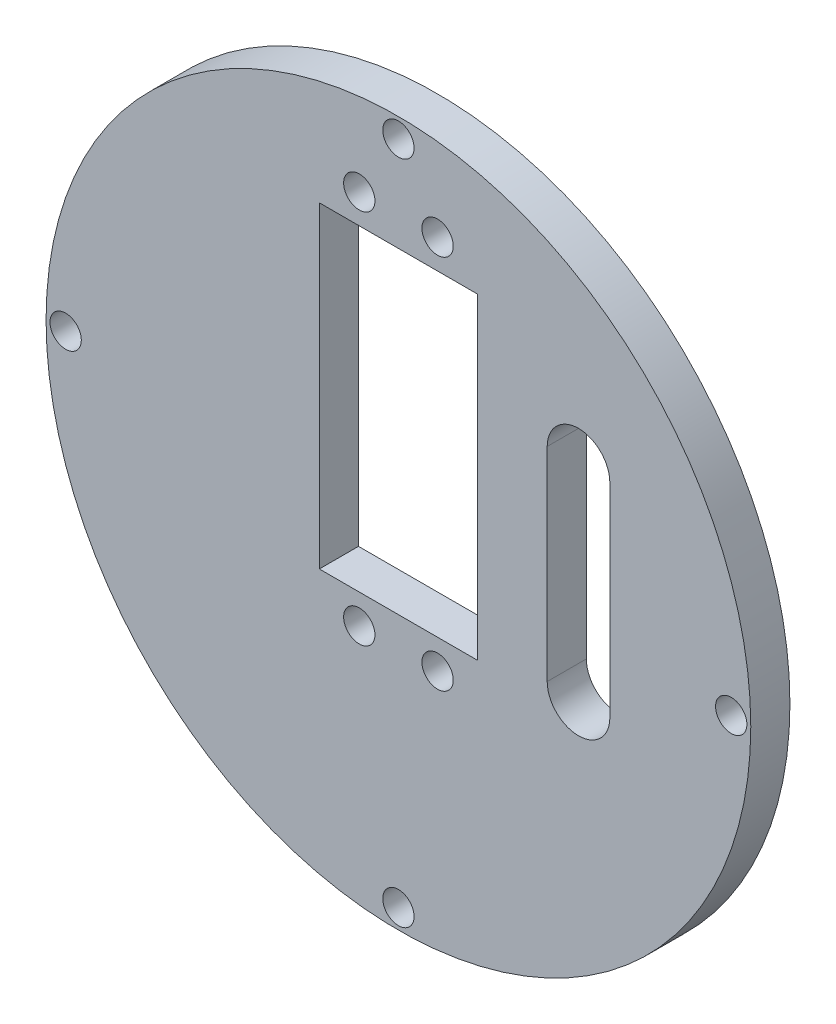
ISO-10303-21;
HEADER;
FILE_DESCRIPTION(('STEP AP214'),'2;1');
FILE_NAME('part.step','',(''),(''),'','','');
FILE_SCHEMA(('AUTOMOTIVE_DESIGN { 1 0 10303 214 1 1 1 1 }'));
ENDSEC;
DATA;
#1=APPLICATION_CONTEXT('core data for automotive mechanical design processes');
#2=APPLICATION_PROTOCOL_DEFINITION('international standard','automotive_design',2000,#1);
#3=PRODUCT_CONTEXT('',#1,'mechanical');
#4=PRODUCT('Part','Part','',(#3));
#5=PRODUCT_RELATED_PRODUCT_CATEGORY('part','',(#4));
#6=PRODUCT_DEFINITION_FORMATION('','',#4);
#7=PRODUCT_DEFINITION_CONTEXT('part definition',#1,'design');
#8=PRODUCT_DEFINITION('design','',#6,#7);
#9=PRODUCT_DEFINITION_SHAPE('','',#8);
#10=(LENGTH_UNIT() NAMED_UNIT(*) SI_UNIT(.MILLI.,.METRE.));
#11=(NAMED_UNIT(*) PLANE_ANGLE_UNIT() SI_UNIT($,.RADIAN.));
#12=(NAMED_UNIT(*) SI_UNIT($,.STERADIAN.) SOLID_ANGLE_UNIT());
#13=UNCERTAINTY_MEASURE_WITH_UNIT(LENGTH_MEASURE(1.E-05),#10,'distance_accuracy_value','');
#14=(GEOMETRIC_REPRESENTATION_CONTEXT(3) GLOBAL_UNCERTAINTY_ASSIGNED_CONTEXT((#13)) GLOBAL_UNIT_ASSIGNED_CONTEXT((#10,
#11,#12)) REPRESENTATION_CONTEXT('',''));
#15=CARTESIAN_POINT('',(0.,0.,0.));
#16=DIRECTION('',(0.,0.,1.));
#17=DIRECTION('',(1.,0.,0.));
#18=AXIS2_PLACEMENT_3D('',#15,#16,#17);
#19=CARTESIAN_POINT('',(0.,30.4,5.));
#20=DIRECTION('',(0.,1.,0.));
#21=DIRECTION('',(0.,0.,1.));
#22=AXIS2_PLACEMENT_3D('',#19,#20,#21);
#23=PLANE('',#22);
#24=DIRECTION('',(1.,0.,0.));
#25=VECTOR('',#24,1.);
#26=CARTESIAN_POINT('',(0.,30.4,0.));
#27=LINE('',#26,#25);
#28=CARTESIAN_POINT('',(-10.1,30.4,0.));
#29=VERTEX_POINT('',#28);
#30=CARTESIAN_POINT('',(10.1,30.4,0.));
#31=VERTEX_POINT('',#30);
#32=EDGE_CURVE('E203',#29,#31,#27,.T.);
#33=ORIENTED_EDGE('',*,*,#32,.T.);
#34=DIRECTION('',(0.,0.,-1.));
#35=VECTOR('',#34,1.);
#36=CARTESIAN_POINT('',(10.1,30.4,5.));
#37=LINE('',#36,#35);
#38=CARTESIAN_POINT('',(10.1,30.4,5.));
#39=VERTEX_POINT('',#38);
#40=EDGE_CURVE('E11',#39,#31,#37,.T.);
#41=ORIENTED_EDGE('',*,*,#40,.F.);
#42=DIRECTION('',(1.,0.,0.));
#43=VECTOR('',#42,1.);
#44=CARTESIAN_POINT('',(0.,30.4,5.));
#45=LINE('',#44,#43);
#46=CARTESIAN_POINT('',(-10.1,30.4,5.));
#47=VERTEX_POINT('',#46);
#48=EDGE_CURVE('E165',#47,#39,#45,.T.);
#49=ORIENTED_EDGE('',*,*,#48,.F.);
#50=DIRECTION('',(0.,0.,-1.));
#51=VECTOR('',#50,1.);
#52=CARTESIAN_POINT('',(-10.1,30.4,5.));
#53=LINE('',#52,#51);
#54=EDGE_CURVE('E179',#47,#29,#53,.T.);
#55=ORIENTED_EDGE('',*,*,#54,.T.);
#56=EDGE_LOOP('',(#33,#41,#49,#55));
#57=FACE_BOUND('',#56,.T.);
#58=ADVANCED_FACE('F39',(#57),#23,.F.);
#59=CARTESIAN_POINT('',(10.1,0.,5.));
#60=DIRECTION('',(1.,0.,0.));
#61=DIRECTION('',(0.,1.,0.));
#62=AXIS2_PLACEMENT_3D('',#59,#60,#61);
#63=PLANE('',#62);
#64=DIRECTION('',(0.,-1.,0.));
#65=VECTOR('',#64,1.);
#66=CARTESIAN_POINT('',(10.1,0.,0.));
#67=LINE('',#66,#65);
#68=CARTESIAN_POINT('',(10.1,-10.1,0.));
#69=VERTEX_POINT('',#68);
#70=EDGE_CURVE('E206',#31,#69,#67,.T.);
#71=ORIENTED_EDGE('',*,*,#70,.T.);
#72=DIRECTION('',(0.,0.,-1.));
#73=VECTOR('',#72,1.);
#74=CARTESIAN_POINT('',(10.1,-10.1,5.));
#75=LINE('',#74,#73);
#76=CARTESIAN_POINT('',(10.1,-10.1,5.));
#77=VERTEX_POINT('',#76);
#78=EDGE_CURVE('E47',#77,#69,#75,.T.);
#79=ORIENTED_EDGE('',*,*,#78,.F.);
#80=DIRECTION('',(0.,-1.,0.));
#81=VECTOR('',#80,1.);
#82=CARTESIAN_POINT('',(10.1,0.,5.));
#83=LINE('',#82,#81);
#84=EDGE_CURVE('E168',#39,#77,#83,.T.);
#85=ORIENTED_EDGE('',*,*,#84,.F.);
#86=ORIENTED_EDGE('',*,*,#40,.T.);
#87=EDGE_LOOP('',(#71,#79,#85,#86));
#88=FACE_BOUND('',#87,.T.);
#89=ADVANCED_FACE('F225',(#88),#63,.F.);
#90=CARTESIAN_POINT('',(0.,-10.1,5.));
#91=DIRECTION('',(0.,1.,0.));
#92=DIRECTION('',(0.,0.,1.));
#93=AXIS2_PLACEMENT_3D('',#90,#91,#92);
#94=PLANE('',#93);
#95=DIRECTION('',(1.,0.,0.));
#96=VECTOR('',#95,1.);
#97=CARTESIAN_POINT('',(0.,-10.1,0.));
#98=LINE('',#97,#96);
#99=CARTESIAN_POINT('',(-10.1,-10.1,0.));
#100=VERTEX_POINT('',#99);
#101=EDGE_CURVE('E209',#100,#69,#98,.T.);
#102=ORIENTED_EDGE('',*,*,#101,.F.);
#103=DIRECTION('',(0.,0.,-1.));
#104=VECTOR('',#103,1.);
#105=CARTESIAN_POINT('',(-10.1,-10.1,5.));
#106=LINE('',#105,#104);
#107=CARTESIAN_POINT('',(-10.1,-10.1,5.));
#108=VERTEX_POINT('',#107);
#109=EDGE_CURVE('E218',#108,#100,#106,.T.);
#110=ORIENTED_EDGE('',*,*,#109,.F.);
#111=DIRECTION('',(1.,0.,0.));
#112=VECTOR('',#111,1.);
#113=CARTESIAN_POINT('',(0.,-10.1,5.));
#114=LINE('',#113,#112);
#115=EDGE_CURVE('E170',#108,#77,#114,.T.);
#116=ORIENTED_EDGE('',*,*,#115,.T.);
#117=ORIENTED_EDGE('',*,*,#78,.T.);
#118=EDGE_LOOP('',(#102,#110,#116,#117));
#119=FACE_BOUND('',#118,.T.);
#120=ADVANCED_FACE('F222',(#119),#94,.T.);
#121=CARTESIAN_POINT('',(-10.1,0.,5.));
#122=DIRECTION('',(1.,0.,0.));
#123=DIRECTION('',(0.,1.,0.));
#124=AXIS2_PLACEMENT_3D('',#121,#122,#123);
#125=PLANE('',#124);
#126=DIRECTION('',(0.,-1.,0.));
#127=VECTOR('',#126,1.);
#128=CARTESIAN_POINT('',(-10.1,0.,0.));
#129=LINE('',#128,#127);
#130=EDGE_CURVE('E212',#29,#100,#129,.T.);
#131=ORIENTED_EDGE('',*,*,#130,.F.);
#132=ORIENTED_EDGE('',*,*,#54,.F.);
#133=DIRECTION('',(0.,-1.,0.));
#134=VECTOR('',#133,1.);
#135=CARTESIAN_POINT('',(-10.1,0.,5.));
#136=LINE('',#135,#134);
#137=EDGE_CURVE('E173',#47,#108,#136,.T.);
#138=ORIENTED_EDGE('',*,*,#137,.T.);
#139=ORIENTED_EDGE('',*,*,#109,.T.);
#140=EDGE_LOOP('',(#131,#132,#138,#139));
#141=FACE_BOUND('',#140,.T.);
#142=ADVANCED_FACE('F232',(#141),#125,.T.);
#143=CARTESIAN_POINT('',(-5.,34.15,5.));
#144=DIRECTION('',(0.,0.,-1.));
#145=DIRECTION('',(-1.,0.,0.));
#146=AXIS2_PLACEMENT_3D('',#143,#144,#145);
#147=CYLINDRICAL_SURFACE('',#146,2.);
#148=CARTESIAN_POINT('',(-5.,34.15,5.));
#149=DIRECTION('',(0.,0.,1.));
#150=DIRECTION('',(1.,0.,0.));
#151=AXIS2_PLACEMENT_3D('',#148,#149,#150);
#152=CIRCLE('',#151,2.);
#153=CARTESIAN_POINT('',(-3.,34.15,5.));
#154=VERTEX_POINT('',#153);
#155=EDGE_CURVE('E162',#154,#154,#152,.T.);
#156=ORIENTED_EDGE('',*,*,#155,.T.);
#157=EDGE_LOOP('',(#156));
#158=FACE_BOUND('',#157,.T.);
#159=CARTESIAN_POINT('',(-5.,34.15,0.));
#160=DIRECTION('',(0.,0.,1.));
#161=DIRECTION('',(1.,0.,0.));
#162=AXIS2_PLACEMENT_3D('',#159,#160,#161);
#163=CIRCLE('',#162,2.);
#164=CARTESIAN_POINT('',(-3.,34.15,0.));
#165=VERTEX_POINT('',#164);
#166=EDGE_CURVE('E200',#165,#165,#163,.T.);
#167=ORIENTED_EDGE('',*,*,#166,.F.);
#168=EDGE_LOOP('',(#167));
#169=FACE_BOUND('',#168,.T.);
#170=ADVANCED_FACE('F247',(#158,#169),#147,.F.);
#171=CARTESIAN_POINT('',(5.,34.15,5.));
#172=DIRECTION('',(0.,0.,-1.));
#173=DIRECTION('',(-1.,0.,0.));
#174=AXIS2_PLACEMENT_3D('',#171,#172,#173);
#175=CYLINDRICAL_SURFACE('',#174,2.);
#176=CARTESIAN_POINT('',(5.,34.15,5.));
#177=DIRECTION('',(0.,0.,1.));
#178=DIRECTION('',(1.,0.,0.));
#179=AXIS2_PLACEMENT_3D('',#176,#177,#178);
#180=CIRCLE('',#179,2.);
#181=CARTESIAN_POINT('',(7.,34.15,5.));
#182=VERTEX_POINT('',#181);
#183=EDGE_CURVE('E159',#182,#182,#180,.T.);
#184=ORIENTED_EDGE('',*,*,#183,.T.);
#185=EDGE_LOOP('',(#184));
#186=FACE_BOUND('',#185,.T.);
#187=CARTESIAN_POINT('',(5.,34.15,0.));
#188=DIRECTION('',(0.,0.,1.));
#189=DIRECTION('',(1.,0.,0.));
#190=AXIS2_PLACEMENT_3D('',#187,#188,#189);
#191=CIRCLE('',#190,2.);
#192=CARTESIAN_POINT('',(7.,34.15,0.));
#193=VERTEX_POINT('',#192);
#194=EDGE_CURVE('E197',#193,#193,#191,.T.);
#195=ORIENTED_EDGE('',*,*,#194,.F.);
#196=EDGE_LOOP('',(#195));
#197=FACE_BOUND('',#196,.T.);
#198=ADVANCED_FACE('F250',(#186,#197),#175,.F.);
#199=CARTESIAN_POINT('',(5.00000000000001,-13.85,5.));
#200=DIRECTION('',(0.,0.,-1.));
#201=DIRECTION('',(-1.,0.,0.));
#202=AXIS2_PLACEMENT_3D('',#199,#200,#201);
#203=CYLINDRICAL_SURFACE('',#202,2.);
#204=CARTESIAN_POINT('',(5.00000000000001,-13.85,5.));
#205=DIRECTION('',(0.,0.,1.));
#206=DIRECTION('',(1.,0.,0.));
#207=AXIS2_PLACEMENT_3D('',#204,#205,#206);
#208=CIRCLE('',#207,2.);
#209=CARTESIAN_POINT('',(7.00000000000001,-13.85,5.));
#210=VERTEX_POINT('',#209);
#211=EDGE_CURVE('E156',#210,#210,#208,.T.);
#212=ORIENTED_EDGE('',*,*,#211,.T.);
#213=EDGE_LOOP('',(#212));
#214=FACE_BOUND('',#213,.T.);
#215=CARTESIAN_POINT('',(5.00000000000001,-13.85,0.));
#216=DIRECTION('',(0.,0.,1.));
#217=DIRECTION('',(1.,0.,0.));
#218=AXIS2_PLACEMENT_3D('',#215,#216,#217);
#219=CIRCLE('',#218,2.);
#220=CARTESIAN_POINT('',(7.00000000000001,-13.85,0.));
#221=VERTEX_POINT('',#220);
#222=EDGE_CURVE('E194',#221,#221,#219,.T.);
#223=ORIENTED_EDGE('',*,*,#222,.F.);
#224=EDGE_LOOP('',(#223));
#225=FACE_BOUND('',#224,.T.);
#226=ADVANCED_FACE('F254',(#214,#225),#203,.F.);
#227=CARTESIAN_POINT('',(-4.99999999999999,-13.85,5.));
#228=DIRECTION('',(0.,0.,-1.));
#229=DIRECTION('',(-1.,0.,0.));
#230=AXIS2_PLACEMENT_3D('',#227,#228,#229);
#231=CYLINDRICAL_SURFACE('',#230,2.);
#232=CARTESIAN_POINT('',(-4.99999999999999,-13.85,5.));
#233=DIRECTION('',(0.,0.,1.));
#234=DIRECTION('',(1.,0.,0.));
#235=AXIS2_PLACEMENT_3D('',#232,#233,#234);
#236=CIRCLE('',#235,2.);
#237=CARTESIAN_POINT('',(-2.99999999999999,-13.85,5.));
#238=VERTEX_POINT('',#237);
#239=EDGE_CURVE('E153',#238,#238,#236,.T.);
#240=ORIENTED_EDGE('',*,*,#239,.T.);
#241=EDGE_LOOP('',(#240));
#242=FACE_BOUND('',#241,.T.);
#243=CARTESIAN_POINT('',(-4.99999999999999,-13.85,0.));
#244=DIRECTION('',(0.,0.,1.));
#245=DIRECTION('',(1.,0.,0.));
#246=AXIS2_PLACEMENT_3D('',#243,#244,#245);
#247=CIRCLE('',#246,2.);
#248=CARTESIAN_POINT('',(-2.99999999999999,-13.85,0.));
#249=VERTEX_POINT('',#248);
#250=EDGE_CURVE('E191',#249,#249,#247,.T.);
#251=ORIENTED_EDGE('',*,*,#250,.F.);
#252=EDGE_LOOP('',(#251));
#253=FACE_BOUND('',#252,.T.);
#254=ADVANCED_FACE('F258',(#242,#253),#231,.F.);
#255=CARTESIAN_POINT('',(42.5,0.,5.));
#256=DIRECTION('',(0.,0.,-1.));
#257=DIRECTION('',(-1.,0.,0.));
#258=AXIS2_PLACEMENT_3D('',#255,#256,#257);
#259=CYLINDRICAL_SURFACE('',#258,2.);
#260=CARTESIAN_POINT('',(42.5,0.,5.));
#261=DIRECTION('',(0.,0.,1.));
#262=DIRECTION('',(1.,0.,0.));
#263=AXIS2_PLACEMENT_3D('',#260,#261,#262);
#264=CIRCLE('',#263,2.);
#265=CARTESIAN_POINT('',(44.5,0.,5.));
#266=VERTEX_POINT('',#265);
#267=EDGE_CURVE('E150',#266,#266,#264,.T.);
#268=ORIENTED_EDGE('',*,*,#267,.T.);
#269=EDGE_LOOP('',(#268));
#270=FACE_BOUND('',#269,.T.);
#271=CARTESIAN_POINT('',(42.5,0.,0.));
#272=DIRECTION('',(0.,0.,1.));
#273=DIRECTION('',(1.,0.,0.));
#274=AXIS2_PLACEMENT_3D('',#271,#272,#273);
#275=CIRCLE('',#274,2.);
#276=CARTESIAN_POINT('',(44.5,0.,0.));
#277=VERTEX_POINT('',#276);
#278=EDGE_CURVE('E188',#277,#277,#275,.T.);
#279=ORIENTED_EDGE('',*,*,#278,.F.);
#280=EDGE_LOOP('',(#279));
#281=FACE_BOUND('',#280,.T.);
#282=ADVANCED_FACE('F262',(#270,#281),#259,.F.);
#283=CARTESIAN_POINT('',(0.,-42.5,5.));
#284=DIRECTION('',(0.,0.,-1.));
#285=DIRECTION('',(-1.,0.,0.));
#286=AXIS2_PLACEMENT_3D('',#283,#284,#285);
#287=CYLINDRICAL_SURFACE('',#286,2.);
#288=CARTESIAN_POINT('',(0.,-42.5,5.));
#289=DIRECTION('',(0.,0.,1.));
#290=DIRECTION('',(1.,0.,0.));
#291=AXIS2_PLACEMENT_3D('',#288,#289,#290);
#292=CIRCLE('',#291,2.);
#293=CARTESIAN_POINT('',(2.00000000000001,-42.5,5.));
#294=VERTEX_POINT('',#293);
#295=EDGE_CURVE('E147',#294,#294,#292,.T.);
#296=ORIENTED_EDGE('',*,*,#295,.T.);
#297=EDGE_LOOP('',(#296));
#298=FACE_BOUND('',#297,.T.);
#299=CARTESIAN_POINT('',(0.,-42.5,0.));
#300=DIRECTION('',(0.,0.,1.));
#301=DIRECTION('',(1.,0.,0.));
#302=AXIS2_PLACEMENT_3D('',#299,#300,#301);
#303=CIRCLE('',#302,2.);
#304=CARTESIAN_POINT('',(2.00000000000001,-42.5,0.));
#305=VERTEX_POINT('',#304);
#306=EDGE_CURVE('E185',#305,#305,#303,.T.);
#307=ORIENTED_EDGE('',*,*,#306,.F.);
#308=EDGE_LOOP('',(#307));
#309=FACE_BOUND('',#308,.T.);
#310=ADVANCED_FACE('F266',(#298,#309),#287,.F.);
#311=CARTESIAN_POINT('',(-42.5,0.,5.));
#312=DIRECTION('',(0.,0.,-1.));
#313=DIRECTION('',(-1.,0.,0.));
#314=AXIS2_PLACEMENT_3D('',#311,#312,#313);
#315=CYLINDRICAL_SURFACE('',#314,2.);
#316=CARTESIAN_POINT('',(-42.5,0.,5.));
#317=DIRECTION('',(0.,0.,1.));
#318=DIRECTION('',(1.,0.,0.));
#319=AXIS2_PLACEMENT_3D('',#316,#317,#318);
#320=CIRCLE('',#319,2.);
#321=CARTESIAN_POINT('',(-40.5,0.,5.));
#322=VERTEX_POINT('',#321);
#323=EDGE_CURVE('E143',#322,#322,#320,.T.);
#324=ORIENTED_EDGE('',*,*,#323,.T.);
#325=EDGE_LOOP('',(#324));
#326=FACE_BOUND('',#325,.T.);
#327=CARTESIAN_POINT('',(-42.5,0.,0.));
#328=DIRECTION('',(0.,0.,1.));
#329=DIRECTION('',(1.,0.,0.));
#330=AXIS2_PLACEMENT_3D('',#327,#328,#329);
#331=CIRCLE('',#330,2.);
#332=CARTESIAN_POINT('',(-40.5,0.,0.));
#333=VERTEX_POINT('',#332);
#334=EDGE_CURVE('E182',#333,#333,#331,.T.);
#335=ORIENTED_EDGE('',*,*,#334,.F.);
#336=EDGE_LOOP('',(#335));
#337=FACE_BOUND('',#336,.T.);
#338=ADVANCED_FACE('F269',(#326,#337),#315,.F.);
#339=CARTESIAN_POINT('',(0.,42.5,5.));
#340=DIRECTION('',(0.,0.,-1.));
#341=DIRECTION('',(-1.,0.,0.));
#342=AXIS2_PLACEMENT_3D('',#339,#340,#341);
#343=CYLINDRICAL_SURFACE('',#342,2.);
#344=CARTESIAN_POINT('',(0.,42.5,5.));
#345=DIRECTION('',(0.,0.,1.));
#346=DIRECTION('',(1.,0.,0.));
#347=AXIS2_PLACEMENT_3D('',#344,#345,#346);
#348=CIRCLE('',#347,2.);
#349=CARTESIAN_POINT('',(1.99999999999999,42.5,5.));
#350=VERTEX_POINT('',#349);
#351=EDGE_CURVE('E140',#350,#350,#348,.T.);
#352=ORIENTED_EDGE('',*,*,#351,.T.);
#353=EDGE_LOOP('',(#352));
#354=FACE_BOUND('',#353,.T.);
#355=CARTESIAN_POINT('',(0.,42.5,0.));
#356=DIRECTION('',(0.,0.,1.));
#357=DIRECTION('',(1.,0.,0.));
#358=AXIS2_PLACEMENT_3D('',#355,#356,#357);
#359=CIRCLE('',#358,2.);
#360=CARTESIAN_POINT('',(1.99999999999999,42.5,0.));
#361=VERTEX_POINT('',#360);
#362=EDGE_CURVE('E139',#361,#361,#359,.T.);
#363=ORIENTED_EDGE('',*,*,#362,.F.);
#364=EDGE_LOOP('',(#363));
#365=FACE_BOUND('',#364,.T.);
#366=ADVANCED_FACE('F41',(#354,#365),#343,.F.);
#367=CARTESIAN_POINT('',(0.,0.,5.));
#368=DIRECTION('',(0.,0.,-1.));
#369=DIRECTION('',(-1.,0.,0.));
#370=AXIS2_PLACEMENT_3D('',#367,#368,#369);
#371=CYLINDRICAL_SURFACE('',#370,45.);
#372=CARTESIAN_POINT('',(0.,0.,5.));
#373=DIRECTION('',(0.,0.,1.));
#374=DIRECTION('',(1.,0.,0.));
#375=AXIS2_PLACEMENT_3D('',#372,#373,#374);
#376=CIRCLE('',#375,45.);
#377=CARTESIAN_POINT('',(45.,0.,5.));
#378=VERTEX_POINT('',#377);
#379=EDGE_CURVE('E176',#378,#378,#376,.T.);
#380=ORIENTED_EDGE('',*,*,#379,.F.);
#381=EDGE_LOOP('',(#380));
#382=FACE_BOUND('',#381,.T.);
#383=CARTESIAN_POINT('',(0.,0.,0.));
#384=DIRECTION('',(0.,0.,1.));
#385=DIRECTION('',(1.,0.,0.));
#386=AXIS2_PLACEMENT_3D('',#383,#384,#385);
#387=CIRCLE('',#386,45.);
#388=CARTESIAN_POINT('',(45.,0.,0.));
#389=VERTEX_POINT('',#388);
#390=EDGE_CURVE('E144',#389,#389,#387,.T.);
#391=ORIENTED_EDGE('',*,*,#390,.T.);
#392=EDGE_LOOP('',(#391));
#393=FACE_BOUND('',#392,.T.);
#394=ADVANCED_FACE('F276',(#382,#393),#371,.T.);
#395=CARTESIAN_POINT('',(0.,0.,5.));
#396=DIRECTION('',(0.,0.,1.));
#397=DIRECTION('',(1.,0.,0.));
#398=AXIS2_PLACEMENT_3D('',#395,#396,#397);
#399=PLANE('',#398);
#400=CARTESIAN_POINT('',(23.,18.,5.));
#401=DIRECTION('',(0.,0.,1.));
#402=DIRECTION('',(1.,0.,0.));
#403=AXIS2_PLACEMENT_3D('',#400,#401,#402);
#404=CIRCLE('',#403,4.);
#405=CARTESIAN_POINT('',(27.,18.,5.));
#406=VERTEX_POINT('',#405);
#407=CARTESIAN_POINT('',(19.,18.,5.));
#408=VERTEX_POINT('',#407);
#409=EDGE_CURVE('E137',#406,#408,#404,.T.);
#410=ORIENTED_EDGE('',*,*,#409,.F.);
#411=DIRECTION('',(0.,1.,0.));
#412=VECTOR('',#411,1.);
#413=CARTESIAN_POINT('',(27.,0.,5.));
#414=LINE('',#413,#412);
#415=CARTESIAN_POINT('',(27.,-8.,5.));
#416=VERTEX_POINT('',#415);
#417=EDGE_CURVE('E130',#416,#406,#414,.T.);
#418=ORIENTED_EDGE('',*,*,#417,.F.);
#419=CARTESIAN_POINT('',(23.,-8.,5.));
#420=DIRECTION('',(0.,0.,1.));
#421=DIRECTION('',(1.,0.,0.));
#422=AXIS2_PLACEMENT_3D('',#419,#420,#421);
#423=CIRCLE('',#422,4.);
#424=CARTESIAN_POINT('',(19.,-8.,5.));
#425=VERTEX_POINT('',#424);
#426=EDGE_CURVE('E110',#425,#416,#423,.T.);
#427=ORIENTED_EDGE('',*,*,#426,.F.);
#428=DIRECTION('',(0.,-1.,0.));
#429=VECTOR('',#428,1.);
#430=CARTESIAN_POINT('',(19.,0.,5.));
#431=LINE('',#430,#429);
#432=EDGE_CURVE('E135',#408,#425,#431,.T.);
#433=ORIENTED_EDGE('',*,*,#432,.F.);
#434=EDGE_LOOP('',(#410,#418,#427,#433));
#435=FACE_BOUND('',#434,.T.);
#436=ORIENTED_EDGE('',*,*,#351,.F.);
#437=EDGE_LOOP('',(#436));
#438=FACE_BOUND('',#437,.T.);
#439=ORIENTED_EDGE('',*,*,#323,.F.);
#440=EDGE_LOOP('',(#439));
#441=FACE_BOUND('',#440,.T.);
#442=ORIENTED_EDGE('',*,*,#295,.F.);
#443=EDGE_LOOP('',(#442));
#444=FACE_BOUND('',#443,.T.);
#445=ORIENTED_EDGE('',*,*,#267,.F.);
#446=EDGE_LOOP('',(#445));
#447=FACE_BOUND('',#446,.T.);
#448=ORIENTED_EDGE('',*,*,#239,.F.);
#449=EDGE_LOOP('',(#448));
#450=FACE_BOUND('',#449,.T.);
#451=ORIENTED_EDGE('',*,*,#211,.F.);
#452=EDGE_LOOP('',(#451));
#453=FACE_BOUND('',#452,.T.);
#454=ORIENTED_EDGE('',*,*,#183,.F.);
#455=EDGE_LOOP('',(#454));
#456=FACE_BOUND('',#455,.T.);
#457=ORIENTED_EDGE('',*,*,#155,.F.);
#458=EDGE_LOOP('',(#457));
#459=FACE_BOUND('',#458,.T.);
#460=ORIENTED_EDGE('',*,*,#48,.T.);
#461=ORIENTED_EDGE('',*,*,#84,.T.);
#462=ORIENTED_EDGE('',*,*,#115,.F.);
#463=ORIENTED_EDGE('',*,*,#137,.F.);
#464=EDGE_LOOP('',(#460,#461,#462,#463));
#465=FACE_BOUND('',#464,.T.);
#466=ORIENTED_EDGE('',*,*,#379,.T.);
#467=EDGE_LOOP('',(#466));
#468=FACE_BOUND('',#467,.T.);
#469=ADVANCED_FACE('F236',(#435,#438,#441,#444,#447,#450,#453,#456,#459,#465,#468),#399,.T.);
#470=CARTESIAN_POINT('',(0.,0.,0.));
#471=DIRECTION('',(0.,0.,1.));
#472=DIRECTION('',(1.,0.,0.));
#473=AXIS2_PLACEMENT_3D('',#470,#471,#472);
#474=PLANE('',#473);
#475=DIRECTION('',(0.,-1.,0.));
#476=VECTOR('',#475,1.);
#477=CARTESIAN_POINT('',(27.,18.,0.));
#478=LINE('',#477,#476);
#479=CARTESIAN_POINT('',(27.,18.,0.));
#480=VERTEX_POINT('',#479);
#481=CARTESIAN_POINT('',(27.,-8.,0.));
#482=VERTEX_POINT('',#481);
#483=EDGE_CURVE('E116',#480,#482,#478,.T.);
#484=ORIENTED_EDGE('',*,*,#483,.F.);
#485=CARTESIAN_POINT('',(23.,18.,0.));
#486=DIRECTION('',(0.,0.,-1.));
#487=DIRECTION('',(-1.,0.,0.));
#488=AXIS2_PLACEMENT_3D('',#485,#486,#487);
#489=CIRCLE('',#488,4.);
#490=CARTESIAN_POINT('',(19.,18.,0.));
#491=VERTEX_POINT('',#490);
#492=EDGE_CURVE('E62',#491,#480,#489,.T.);
#493=ORIENTED_EDGE('',*,*,#492,.F.);
#494=DIRECTION('',(0.,1.,0.));
#495=VECTOR('',#494,1.);
#496=CARTESIAN_POINT('',(19.,18.,0.));
#497=LINE('',#496,#495);
#498=CARTESIAN_POINT('',(19.,-8.,0.));
#499=VERTEX_POINT('',#498);
#500=EDGE_CURVE('E123',#499,#491,#497,.T.);
#501=ORIENTED_EDGE('',*,*,#500,.F.);
#502=CARTESIAN_POINT('',(23.,-8.,0.));
#503=DIRECTION('',(0.,0.,-1.));
#504=DIRECTION('',(-1.,0.,0.));
#505=AXIS2_PLACEMENT_3D('',#502,#503,#504);
#506=CIRCLE('',#505,4.);
#507=EDGE_CURVE('E107',#482,#499,#506,.T.);
#508=ORIENTED_EDGE('',*,*,#507,.F.);
#509=EDGE_LOOP('',(#484,#493,#501,#508));
#510=FACE_BOUND('',#509,.T.);
#511=ORIENTED_EDGE('',*,*,#362,.T.);
#512=EDGE_LOOP('',(#511));
#513=FACE_BOUND('',#512,.T.);
#514=ORIENTED_EDGE('',*,*,#334,.T.);
#515=EDGE_LOOP('',(#514));
#516=FACE_BOUND('',#515,.T.);
#517=ORIENTED_EDGE('',*,*,#306,.T.);
#518=EDGE_LOOP('',(#517));
#519=FACE_BOUND('',#518,.T.);
#520=ORIENTED_EDGE('',*,*,#278,.T.);
#521=EDGE_LOOP('',(#520));
#522=FACE_BOUND('',#521,.T.);
#523=ORIENTED_EDGE('',*,*,#250,.T.);
#524=EDGE_LOOP('',(#523));
#525=FACE_BOUND('',#524,.T.);
#526=ORIENTED_EDGE('',*,*,#222,.T.);
#527=EDGE_LOOP('',(#526));
#528=FACE_BOUND('',#527,.T.);
#529=ORIENTED_EDGE('',*,*,#194,.T.);
#530=EDGE_LOOP('',(#529));
#531=FACE_BOUND('',#530,.T.);
#532=ORIENTED_EDGE('',*,*,#166,.T.);
#533=EDGE_LOOP('',(#532));
#534=FACE_BOUND('',#533,.T.);
#535=ORIENTED_EDGE('',*,*,#32,.F.);
#536=ORIENTED_EDGE('',*,*,#130,.T.);
#537=ORIENTED_EDGE('',*,*,#101,.T.);
#538=ORIENTED_EDGE('',*,*,#70,.F.);
#539=EDGE_LOOP('',(#535,#536,#537,#538));
#540=FACE_BOUND('',#539,.T.);
#541=ORIENTED_EDGE('',*,*,#390,.F.);
#542=EDGE_LOOP('',(#541));
#543=FACE_BOUND('',#542,.T.);
#544=ADVANCED_FACE('F120',(#510,#513,#516,#519,#522,#525,#528,#531,#534,#540,#543),#474,.F.);
#545=CARTESIAN_POINT('',(23.,18.,10.));
#546=DIRECTION('',(0.,0.,-1.));
#547=DIRECTION('',(-1.,0.,0.));
#548=AXIS2_PLACEMENT_3D('',#545,#546,#547);
#549=CYLINDRICAL_SURFACE('',#548,4.);
#550=ORIENTED_EDGE('',*,*,#409,.T.);
#551=DIRECTION('',(0.,0.,-1.));
#552=VECTOR('',#551,1.);
#553=CARTESIAN_POINT('',(19.,18.,10.));
#554=LINE('',#553,#552);
#555=EDGE_CURVE('E128',#408,#491,#554,.T.);
#556=ORIENTED_EDGE('',*,*,#555,.T.);
#557=ORIENTED_EDGE('',*,*,#492,.T.);
#558=DIRECTION('',(0.,0.,-1.));
#559=VECTOR('',#558,1.);
#560=CARTESIAN_POINT('',(27.,18.,10.));
#561=LINE('',#560,#559);
#562=EDGE_CURVE('E113',#406,#480,#561,.T.);
#563=ORIENTED_EDGE('',*,*,#562,.F.);
#564=EDGE_LOOP('',(#550,#556,#557,#563));
#565=FACE_BOUND('',#564,.T.);
#566=ADVANCED_FACE('F284',(#565),#549,.F.);
#567=CARTESIAN_POINT('',(19.,18.,10.));
#568=DIRECTION('',(-1.,0.,0.));
#569=DIRECTION('',(0.,0.,1.));
#570=AXIS2_PLACEMENT_3D('',#567,#568,#569);
#571=PLANE('',#570);
#572=ORIENTED_EDGE('',*,*,#432,.T.);
#573=DIRECTION('',(0.,0.,-1.));
#574=VECTOR('',#573,1.);
#575=CARTESIAN_POINT('',(19.,-8.,10.));
#576=LINE('',#575,#574);
#577=EDGE_CURVE('E112',#425,#499,#576,.T.);
#578=ORIENTED_EDGE('',*,*,#577,.T.);
#579=ORIENTED_EDGE('',*,*,#500,.T.);
#580=ORIENTED_EDGE('',*,*,#555,.F.);
#581=EDGE_LOOP('',(#572,#578,#579,#580));
#582=FACE_BOUND('',#581,.T.);
#583=ADVANCED_FACE('F308',(#582),#571,.F.);
#584=CARTESIAN_POINT('',(23.,-8.,10.));
#585=DIRECTION('',(0.,0.,-1.));
#586=DIRECTION('',(-1.,0.,0.));
#587=AXIS2_PLACEMENT_3D('',#584,#585,#586);
#588=CYLINDRICAL_SURFACE('',#587,4.);
#589=ORIENTED_EDGE('',*,*,#426,.T.);
#590=DIRECTION('',(0.,0.,-1.));
#591=VECTOR('',#590,1.);
#592=CARTESIAN_POINT('',(27.,-8.,10.));
#593=LINE('',#592,#591);
#594=EDGE_CURVE('E54',#416,#482,#593,.T.);
#595=ORIENTED_EDGE('',*,*,#594,.T.);
#596=ORIENTED_EDGE('',*,*,#507,.T.);
#597=ORIENTED_EDGE('',*,*,#577,.F.);
#598=EDGE_LOOP('',(#589,#595,#596,#597));
#599=FACE_BOUND('',#598,.T.);
#600=ADVANCED_FACE('F104',(#599),#588,.F.);
#601=CARTESIAN_POINT('',(27.,18.,10.));
#602=DIRECTION('',(1.,0.,0.));
#603=DIRECTION('',(0.,0.,-1.));
#604=AXIS2_PLACEMENT_3D('',#601,#602,#603);
#605=PLANE('',#604);
#606=ORIENTED_EDGE('',*,*,#417,.T.);
#607=ORIENTED_EDGE('',*,*,#562,.T.);
#608=ORIENTED_EDGE('',*,*,#483,.T.);
#609=ORIENTED_EDGE('',*,*,#594,.F.);
#610=EDGE_LOOP('',(#606,#607,#608,#609));
#611=FACE_BOUND('',#610,.T.);
#612=ADVANCED_FACE('F117',(#611),#605,.F.);
#613=CLOSED_SHELL('',(#58,#89,#120,#142,#170,#198,#226,#254,#282,#310,#338,#366,#394,#469,#544,
#566,#583,#600,#612));
#614=MANIFOLD_SOLID_BREP('B2',#613);
#615=ADVANCED_BREP_SHAPE_REPRESENTATION('',(#18,#614),#14);
#616=SHAPE_DEFINITION_REPRESENTATION(#9,#615);
ENDSEC;
END-ISO-10303-21;
